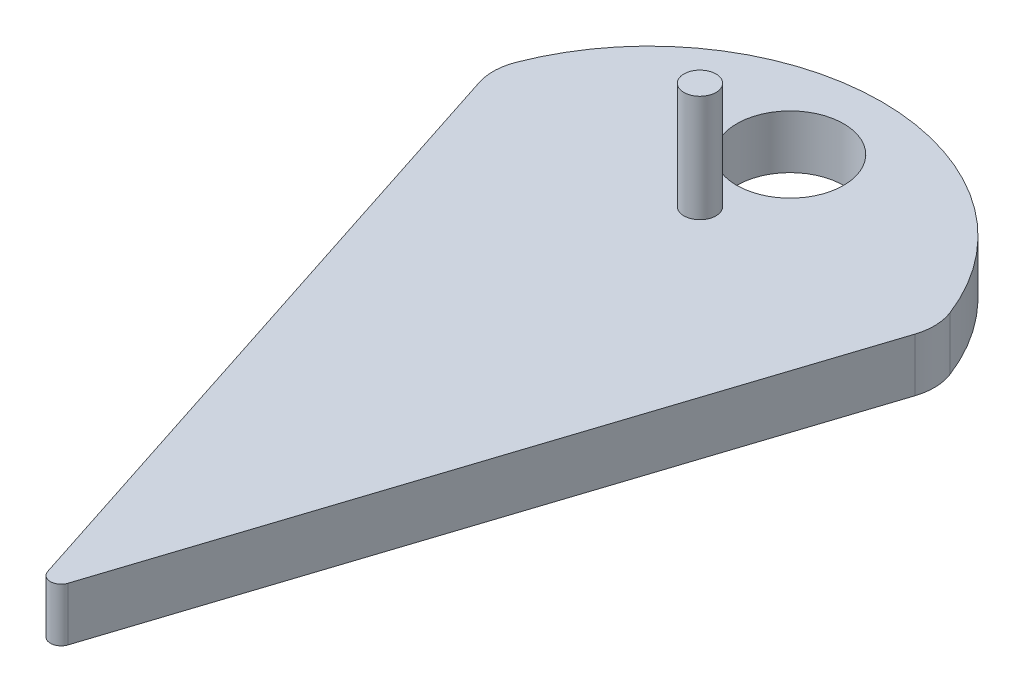
ISO-10303-21;
HEADER;
FILE_DESCRIPTION(('STEP AP214'),'2;1');
FILE_NAME('part.step','',(''),(''),'','','');
FILE_SCHEMA(('AUTOMOTIVE_DESIGN { 1 0 10303 214 1 1 1 1 }'));
ENDSEC;
DATA;
#1=APPLICATION_CONTEXT('core data for automotive mechanical design processes');
#2=APPLICATION_PROTOCOL_DEFINITION('international standard','automotive_design',2000,#1);
#3=PRODUCT_CONTEXT('',#1,'mechanical');
#4=PRODUCT('Part','Part','',(#3));
#5=PRODUCT_RELATED_PRODUCT_CATEGORY('part','',(#4));
#6=PRODUCT_DEFINITION_FORMATION('','',#4);
#7=PRODUCT_DEFINITION_CONTEXT('part definition',#1,'design');
#8=PRODUCT_DEFINITION('design','',#6,#7);
#9=PRODUCT_DEFINITION_SHAPE('','',#8);
#10=(LENGTH_UNIT() NAMED_UNIT(*) SI_UNIT(.MILLI.,.METRE.));
#11=(NAMED_UNIT(*) PLANE_ANGLE_UNIT() SI_UNIT($,.RADIAN.));
#12=(NAMED_UNIT(*) SI_UNIT($,.STERADIAN.) SOLID_ANGLE_UNIT());
#13=UNCERTAINTY_MEASURE_WITH_UNIT(LENGTH_MEASURE(1.E-05),#10,'distance_accuracy_value','');
#14=(GEOMETRIC_REPRESENTATION_CONTEXT(3) GLOBAL_UNCERTAINTY_ASSIGNED_CONTEXT((#13)) GLOBAL_UNIT_ASSIGNED_CONTEXT((#10,
#11,#12)) REPRESENTATION_CONTEXT('',''));
#15=CARTESIAN_POINT('',(0.,0.,0.));
#16=DIRECTION('',(0.,0.,1.));
#17=DIRECTION('',(1.,0.,0.));
#18=AXIS2_PLACEMENT_3D('',#15,#16,#17);
#19=CARTESIAN_POINT('',(0.,5.,-3.23606797749978));
#20=DIRECTION('',(0.,1.,0.));
#21=DIRECTION('',(0.,0.,1.));
#22=AXIS2_PLACEMENT_3D('',#19,#20,#21);
#23=PLANE('',#22);
#24=CARTESIAN_POINT('',(0.,5.,-62.999));
#25=DIRECTION('',(0.,1.,0.));
#26=DIRECTION('',(0.,0.,1.));
#27=AXIS2_PLACEMENT_3D('',#24,#25,#26);
#28=CIRCLE('',#27,1.5);
#29=CARTESIAN_POINT('',(0.,5.,-61.499));
#30=VERTEX_POINT('',#29);
#31=EDGE_CURVE('E182',#30,#30,#28,.T.);
#32=ORIENTED_EDGE('',*,*,#31,.F.);
#33=EDGE_LOOP('',(#32));
#34=FACE_BOUND('',#33,.T.);
#35=CARTESIAN_POINT('',(0.,5.,-3.23606797749978));
#36=DIRECTION('',(0.,1.,0.));
#37=DIRECTION('',(0.,0.,1.));
#38=AXIS2_PLACEMENT_3D('',#35,#36,#37);
#39=CIRCLE('',#38,1.);
#40=CARTESIAN_POINT('',(-0.951056516295165,5.,-2.92705098312486));
#41=VERTEX_POINT('',#40);
#42=CARTESIAN_POINT('',(0.951056516295165,5.,-2.92705098312486));
#43=VERTEX_POINT('',#42);
#44=EDGE_CURVE('E135',#41,#43,#39,.T.);
#45=ORIENTED_EDGE('',*,*,#44,.T.);
#46=DIRECTION('',(0.309016994374949,0.,-0.951056516295153));
#47=VECTOR('',#46,1.);
#48=CARTESIAN_POINT('',(0.951056516295165,5.,-2.92705098312486));
#49=LINE('',#48,#47);
#50=CARTESIAN_POINT('',(20.386221797104,5.,-62.7423392101499));
#51=VERTEX_POINT('',#50);
#52=EDGE_CURVE('E93',#43,#51,#49,.T.);
#53=ORIENTED_EDGE('',*,*,#52,.T.);
#54=CARTESIAN_POINT('',(15.6309392156282,5.,-64.2874241820247));
#55=DIRECTION('',(0.,1.,0.));
#56=DIRECTION('',(0.,0.,1.));
#57=AXIS2_PLACEMENT_3D('',#54,#55,#56);
#58=CIRCLE('',#57,5.00000000000001);
#59=CARTESIAN_POINT('',(20.2941072393836,5.,-66.0915483413399));
#60=VERTEX_POINT('',#59);
#61=EDGE_CURVE('E106',#51,#60,#58,.T.);
#62=ORIENTED_EDGE('',*,*,#61,.T.);
#63=CARTESIAN_POINT('',(0.,5.,-58.24));
#64=DIRECTION('',(0.,1.,0.));
#65=DIRECTION('',(0.,0.,-1.));
#66=AXIS2_PLACEMENT_3D('',#63,#64,#65);
#67=CIRCLE('',#66,21.76);
#68=CARTESIAN_POINT('',(-20.2941072393836,5.,-66.0915483413399));
#69=VERTEX_POINT('',#68);
#70=EDGE_CURVE('E100',#60,#69,#67,.T.);
#71=ORIENTED_EDGE('',*,*,#70,.T.);
#72=CARTESIAN_POINT('',(-15.6309392156282,5.,-64.2874241820247));
#73=DIRECTION('',(0.,1.,0.));
#74=DIRECTION('',(0.,0.,-1.));
#75=AXIS2_PLACEMENT_3D('',#72,#73,#74);
#76=CIRCLE('',#75,5.00000000000001);
#77=CARTESIAN_POINT('',(-20.386221797104,5.,-62.7423392101499));
#78=VERTEX_POINT('',#77);
#79=EDGE_CURVE('E104',#69,#78,#76,.T.);
#80=ORIENTED_EDGE('',*,*,#79,.T.);
#81=DIRECTION('',(0.309016994374949,0.,0.951056516295153));
#82=VECTOR('',#81,1.);
#83=CARTESIAN_POINT('',(-0.951056516295165,5.,-2.92705098312486));
#84=LINE('',#83,#82);
#85=EDGE_CURVE('E56',#78,#41,#84,.T.);
#86=ORIENTED_EDGE('',*,*,#85,.T.);
#87=EDGE_LOOP('',(#45,#53,#62,#71,#80,#86));
#88=FACE_BOUND('',#87,.T.);
#89=CARTESIAN_POINT('',(0.,5.,-71.439));
#90=DIRECTION('',(0.,1.,0.));
#91=DIRECTION('',(0.,0.,1.));
#92=AXIS2_PLACEMENT_3D('',#89,#90,#91);
#93=CIRCLE('',#92,5.);
#94=CARTESIAN_POINT('',(0.,5.,-66.439));
#95=VERTEX_POINT('',#94);
#96=EDGE_CURVE('E128',#95,#95,#93,.T.);
#97=ORIENTED_EDGE('',*,*,#96,.F.);
#98=EDGE_LOOP('',(#97));
#99=FACE_BOUND('',#98,.T.);
#100=ADVANCED_FACE('F39',(#34,#88,#99),#23,.T.);
#101=CARTESIAN_POINT('',(0.,0.,-3.23606797749978));
#102=DIRECTION('',(0.,1.,0.));
#103=DIRECTION('',(0.,0.,1.));
#104=AXIS2_PLACEMENT_3D('',#101,#102,#103);
#105=PLANE('',#104);
#106=CARTESIAN_POINT('',(0.,0.,-3.23606797749978));
#107=DIRECTION('',(0.,1.,0.));
#108=DIRECTION('',(0.,0.,1.));
#109=AXIS2_PLACEMENT_3D('',#106,#107,#108);
#110=CIRCLE('',#109,1.);
#111=CARTESIAN_POINT('',(-0.951056516295165,0.,-2.92705098312486));
#112=VERTEX_POINT('',#111);
#113=CARTESIAN_POINT('',(0.951056516295165,0.,-2.92705098312486));
#114=VERTEX_POINT('',#113);
#115=EDGE_CURVE('E124',#112,#114,#110,.T.);
#116=ORIENTED_EDGE('',*,*,#115,.F.);
#117=DIRECTION('',(0.309016994374949,0.,0.951056516295153));
#118=VECTOR('',#117,1.);
#119=CARTESIAN_POINT('',(-0.951056516295165,0.,-2.92705098312486));
#120=LINE('',#119,#118);
#121=CARTESIAN_POINT('',(-20.386221797104,0.,-62.7423392101499));
#122=VERTEX_POINT('',#121);
#123=EDGE_CURVE('E85',#122,#112,#120,.T.);
#124=ORIENTED_EDGE('',*,*,#123,.F.);
#125=CARTESIAN_POINT('',(-15.6309392156282,0.,-64.2874241820247));
#126=DIRECTION('',(0.,1.,0.));
#127=DIRECTION('',(0.,0.,-1.));
#128=AXIS2_PLACEMENT_3D('',#125,#126,#127);
#129=CIRCLE('',#128,5.00000000000001);
#130=CARTESIAN_POINT('',(-20.2941072393836,0.,-66.0915483413399));
#131=VERTEX_POINT('',#130);
#132=EDGE_CURVE('E79',#131,#122,#129,.T.);
#133=ORIENTED_EDGE('',*,*,#132,.F.);
#134=CARTESIAN_POINT('',(0.,0.,-58.24));
#135=DIRECTION('',(0.,1.,0.));
#136=DIRECTION('',(0.,0.,-1.));
#137=AXIS2_PLACEMENT_3D('',#134,#135,#136);
#138=CIRCLE('',#137,21.76);
#139=CARTESIAN_POINT('',(20.2941072393836,0.,-66.0915483413399));
#140=VERTEX_POINT('',#139);
#141=EDGE_CURVE('E114',#140,#131,#138,.T.);
#142=ORIENTED_EDGE('',*,*,#141,.F.);
#143=CARTESIAN_POINT('',(15.6309392156282,0.,-64.2874241820247));
#144=DIRECTION('',(0.,1.,0.));
#145=DIRECTION('',(0.,0.,1.));
#146=AXIS2_PLACEMENT_3D('',#143,#144,#145);
#147=CIRCLE('',#146,5.00000000000001);
#148=CARTESIAN_POINT('',(20.386221797104,0.,-62.7423392101499));
#149=VERTEX_POINT('',#148);
#150=EDGE_CURVE('E130',#149,#140,#147,.T.);
#151=ORIENTED_EDGE('',*,*,#150,.F.);
#152=DIRECTION('',(0.309016994374949,0.,-0.951056516295153));
#153=VECTOR('',#152,1.);
#154=CARTESIAN_POINT('',(0.951056516295165,0.,-2.92705098312486));
#155=LINE('',#154,#153);
#156=EDGE_CURVE('E127',#114,#149,#155,.T.);
#157=ORIENTED_EDGE('',*,*,#156,.F.);
#158=EDGE_LOOP('',(#116,#124,#133,#142,#151,#157));
#159=FACE_BOUND('',#158,.T.);
#160=CARTESIAN_POINT('',(0.,0.,-71.439));
#161=DIRECTION('',(0.,1.,0.));
#162=DIRECTION('',(0.,0.,1.));
#163=AXIS2_PLACEMENT_3D('',#160,#161,#162);
#164=CIRCLE('',#163,5.);
#165=CARTESIAN_POINT('',(0.,0.,-66.439));
#166=VERTEX_POINT('',#165);
#167=EDGE_CURVE('E181',#166,#166,#164,.T.);
#168=ORIENTED_EDGE('',*,*,#167,.T.);
#169=EDGE_LOOP('',(#168));
#170=FACE_BOUND('',#169,.T.);
#171=ADVANCED_FACE('F144',(#159,#170),#105,.F.);
#172=CARTESIAN_POINT('',(0.,5.,-3.23606797749978));
#173=DIRECTION('',(0.,-1.,0.));
#174=DIRECTION('',(0.,0.,-1.));
#175=AXIS2_PLACEMENT_3D('',#172,#173,#174);
#176=CYLINDRICAL_SURFACE('',#175,1.);
#177=ORIENTED_EDGE('',*,*,#115,.T.);
#178=DIRECTION('',(0.,-1.,0.));
#179=VECTOR('',#178,1.);
#180=CARTESIAN_POINT('',(0.951056516295165,5.,-2.92705098312486));
#181=LINE('',#180,#179);
#182=EDGE_CURVE('E11',#43,#114,#181,.T.);
#183=ORIENTED_EDGE('',*,*,#182,.F.);
#184=ORIENTED_EDGE('',*,*,#44,.F.);
#185=DIRECTION('',(0.,-1.,0.));
#186=VECTOR('',#185,1.);
#187=CARTESIAN_POINT('',(-0.951056516295165,5.,-2.92705098312486));
#188=LINE('',#187,#186);
#189=EDGE_CURVE('E120',#41,#112,#188,.T.);
#190=ORIENTED_EDGE('',*,*,#189,.T.);
#191=EDGE_LOOP('',(#177,#183,#184,#190));
#192=FACE_BOUND('',#191,.T.);
#193=ADVANCED_FACE('F41',(#192),#176,.T.);
#194=CARTESIAN_POINT('',(0.951056516295165,5.,-2.92705098312486));
#195=DIRECTION('',(-0.951056516295153,0.,-0.309016994374949));
#196=DIRECTION('',(-0.309016994374949,0.,0.951056516295153));
#197=AXIS2_PLACEMENT_3D('',#194,#195,#196);
#198=PLANE('',#197);
#199=ORIENTED_EDGE('',*,*,#156,.T.);
#200=DIRECTION('',(0.,-1.,0.));
#201=VECTOR('',#200,1.);
#202=CARTESIAN_POINT('',(20.386221797104,5.,-62.7423392101499));
#203=LINE('',#202,#201);
#204=EDGE_CURVE('E48',#51,#149,#203,.T.);
#205=ORIENTED_EDGE('',*,*,#204,.F.);
#206=ORIENTED_EDGE('',*,*,#52,.F.);
#207=ORIENTED_EDGE('',*,*,#182,.T.);
#208=EDGE_LOOP('',(#199,#205,#206,#207));
#209=FACE_BOUND('',#208,.T.);
#210=ADVANCED_FACE('F235',(#209),#198,.F.);
#211=CARTESIAN_POINT('',(15.6309392156282,5.,-64.2874241820247));
#212=DIRECTION('',(0.,-1.,0.));
#213=DIRECTION('',(0.,0.,-1.));
#214=AXIS2_PLACEMENT_3D('',#211,#212,#213);
#215=CYLINDRICAL_SURFACE('',#214,5.00000000000001);
#216=ORIENTED_EDGE('',*,*,#150,.T.);
#217=DIRECTION('',(0.,-1.,0.));
#218=VECTOR('',#217,1.);
#219=CARTESIAN_POINT('',(20.2941072393836,5.,-66.0915483413399));
#220=LINE('',#219,#218);
#221=EDGE_CURVE('E115',#60,#140,#220,.T.);
#222=ORIENTED_EDGE('',*,*,#221,.F.);
#223=ORIENTED_EDGE('',*,*,#61,.F.);
#224=ORIENTED_EDGE('',*,*,#204,.T.);
#225=EDGE_LOOP('',(#216,#222,#223,#224));
#226=FACE_BOUND('',#225,.T.);
#227=ADVANCED_FACE('F141',(#226),#215,.T.);
#228=CARTESIAN_POINT('',(0.,5.,-58.24));
#229=DIRECTION('',(0.,-1.,0.));
#230=DIRECTION('',(0.,0.,-1.));
#231=AXIS2_PLACEMENT_3D('',#228,#229,#230);
#232=CYLINDRICAL_SURFACE('',#231,21.76);
#233=ORIENTED_EDGE('',*,*,#141,.T.);
#234=DIRECTION('',(0.,-1.,0.));
#235=VECTOR('',#234,1.);
#236=CARTESIAN_POINT('',(-20.2941072393836,5.,-66.0915483413399));
#237=LINE('',#236,#235);
#238=EDGE_CURVE('E111',#69,#131,#237,.T.);
#239=ORIENTED_EDGE('',*,*,#238,.F.);
#240=ORIENTED_EDGE('',*,*,#70,.F.);
#241=ORIENTED_EDGE('',*,*,#221,.T.);
#242=EDGE_LOOP('',(#233,#239,#240,#241));
#243=FACE_BOUND('',#242,.T.);
#244=ADVANCED_FACE('F112',(#243),#232,.T.);
#245=CARTESIAN_POINT('',(-15.6309392156282,5.,-64.2874241820247));
#246=DIRECTION('',(0.,-1.,0.));
#247=DIRECTION('',(0.,0.,-1.));
#248=AXIS2_PLACEMENT_3D('',#245,#246,#247);
#249=CYLINDRICAL_SURFACE('',#248,5.00000000000001);
#250=ORIENTED_EDGE('',*,*,#132,.T.);
#251=DIRECTION('',(0.,-1.,0.));
#252=VECTOR('',#251,1.);
#253=CARTESIAN_POINT('',(-20.386221797104,5.,-62.7423392101499));
#254=LINE('',#253,#252);
#255=EDGE_CURVE('E116',#78,#122,#254,.T.);
#256=ORIENTED_EDGE('',*,*,#255,.F.);
#257=ORIENTED_EDGE('',*,*,#79,.F.);
#258=ORIENTED_EDGE('',*,*,#238,.T.);
#259=EDGE_LOOP('',(#250,#256,#257,#258));
#260=FACE_BOUND('',#259,.T.);
#261=ADVANCED_FACE('F118',(#260),#249,.T.);
#262=CARTESIAN_POINT('',(-0.951056516295165,5.,-2.92705098312486));
#263=DIRECTION('',(0.951056516295153,0.,-0.309016994374949));
#264=DIRECTION('',(-0.309016994374949,0.,-0.951056516295153));
#265=AXIS2_PLACEMENT_3D('',#262,#263,#264);
#266=PLANE('',#265);
#267=ORIENTED_EDGE('',*,*,#123,.T.);
#268=ORIENTED_EDGE('',*,*,#189,.F.);
#269=ORIENTED_EDGE('',*,*,#85,.F.);
#270=ORIENTED_EDGE('',*,*,#255,.T.);
#271=EDGE_LOOP('',(#267,#268,#269,#270));
#272=FACE_BOUND('',#271,.T.);
#273=ADVANCED_FACE('F149',(#272),#266,.F.);
#274=CARTESIAN_POINT('',(0.,5.,-71.439));
#275=DIRECTION('',(0.,-1.,0.));
#276=DIRECTION('',(0.,0.,-1.));
#277=AXIS2_PLACEMENT_3D('',#274,#275,#276);
#278=CYLINDRICAL_SURFACE('',#277,5.);
#279=ORIENTED_EDGE('',*,*,#96,.T.);
#280=EDGE_LOOP('',(#279));
#281=FACE_BOUND('',#280,.T.);
#282=ORIENTED_EDGE('',*,*,#167,.F.);
#283=EDGE_LOOP('',(#282));
#284=FACE_BOUND('',#283,.T.);
#285=ADVANCED_FACE('F151',(#281,#284),#278,.F.);
#286=CARTESIAN_POINT('',(0.,15.,-62.999));
#287=DIRECTION('',(0.,-1.,0.));
#288=DIRECTION('',(0.,0.,-1.));
#289=AXIS2_PLACEMENT_3D('',#286,#287,#288);
#290=CYLINDRICAL_SURFACE('',#289,1.5);
#291=CARTESIAN_POINT('',(0.,15.,-62.999));
#292=DIRECTION('',(0.,1.,0.));
#293=DIRECTION('',(0.,0.,1.));
#294=AXIS2_PLACEMENT_3D('',#291,#292,#293);
#295=CIRCLE('',#294,1.5);
#296=CARTESIAN_POINT('',(0.,15.,-61.499));
#297=VERTEX_POINT('',#296);
#298=EDGE_CURVE('E180',#297,#297,#295,.T.);
#299=ORIENTED_EDGE('',*,*,#298,.F.);
#300=EDGE_LOOP('',(#299));
#301=FACE_BOUND('',#300,.T.);
#302=ORIENTED_EDGE('',*,*,#31,.T.);
#303=EDGE_LOOP('',(#302));
#304=FACE_BOUND('',#303,.T.);
#305=ADVANCED_FACE('F157',(#301,#304),#290,.T.);
#306=CARTESIAN_POINT('',(0.,15.,-62.999));
#307=DIRECTION('',(0.,1.,0.));
#308=DIRECTION('',(0.,0.,1.));
#309=AXIS2_PLACEMENT_3D('',#306,#307,#308);
#310=PLANE('',#309);
#311=ORIENTED_EDGE('',*,*,#298,.T.);
#312=EDGE_LOOP('',(#311));
#313=FACE_BOUND('',#312,.T.);
#314=ADVANCED_FACE('F172',(#313),#310,.T.);
#315=CLOSED_SHELL('',(#100,#171,#193,#210,#227,#244,#261,#273,#285,#305,#314));
#316=MANIFOLD_SOLID_BREP('B2',#315);
#317=ADVANCED_BREP_SHAPE_REPRESENTATION('',(#18,#316),#14);
#318=SHAPE_DEFINITION_REPRESENTATION(#9,#317);
ENDSEC;
END-ISO-10303-21;
